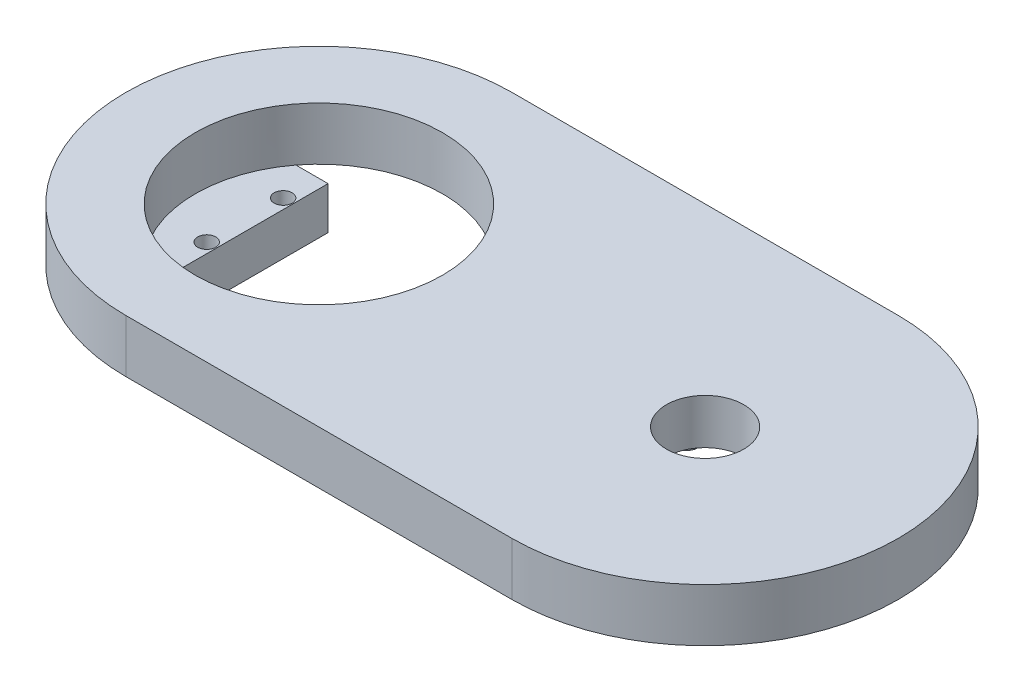
ISO-10303-21;
HEADER;
FILE_DESCRIPTION(('STEP AP214'),'2;1');
FILE_NAME('part.step','',(''),(''),'','','');
FILE_SCHEMA(('AUTOMOTIVE_DESIGN { 1 0 10303 214 1 1 1 1 }'));
ENDSEC;
DATA;
#1=APPLICATION_CONTEXT('core data for automotive mechanical design processes');
#2=APPLICATION_PROTOCOL_DEFINITION('international standard','automotive_design',2000,#1);
#3=PRODUCT_CONTEXT('',#1,'mechanical');
#4=PRODUCT('Part','Part','',(#3));
#5=PRODUCT_RELATED_PRODUCT_CATEGORY('part','',(#4));
#6=PRODUCT_DEFINITION_FORMATION('','',#4);
#7=PRODUCT_DEFINITION_CONTEXT('part definition',#1,'design');
#8=PRODUCT_DEFINITION('design','',#6,#7);
#9=PRODUCT_DEFINITION_SHAPE('','',#8);
#10=(LENGTH_UNIT() NAMED_UNIT(*) SI_UNIT(.MILLI.,.METRE.));
#11=(NAMED_UNIT(*) PLANE_ANGLE_UNIT() SI_UNIT($,.RADIAN.));
#12=(NAMED_UNIT(*) SI_UNIT($,.STERADIAN.) SOLID_ANGLE_UNIT());
#13=UNCERTAINTY_MEASURE_WITH_UNIT(LENGTH_MEASURE(1.E-05),#10,'distance_accuracy_value','');
#14=(GEOMETRIC_REPRESENTATION_CONTEXT(3) GLOBAL_UNCERTAINTY_ASSIGNED_CONTEXT((#13)) GLOBAL_UNIT_ASSIGNED_CONTEXT((#10,
#11,#12)) REPRESENTATION_CONTEXT('',''));
#15=CARTESIAN_POINT('',(0.,0.,0.));
#16=DIRECTION('',(0.,0.,1.));
#17=DIRECTION('',(1.,0.,0.));
#18=AXIS2_PLACEMENT_3D('',#15,#16,#17);
#19=CARTESIAN_POINT('',(-13.2640521637271,0.,0.));
#20=DIRECTION('',(0.,1.,0.));
#21=DIRECTION('',(0.,0.,1.));
#22=AXIS2_PLACEMENT_3D('',#19,#20,#21);
#23=PLANE('',#22);
#24=CARTESIAN_POINT('',(36.7359478362729,0.,0.));
#25=DIRECTION('',(0.,1.,0.));
#26=DIRECTION('',(0.,0.,1.));
#27=AXIS2_PLACEMENT_3D('',#24,#25,#26);
#28=CIRCLE('',#27,12.);
#29=CARTESIAN_POINT('',(36.7359478362729,0.,12.));
#30=VERTEX_POINT('',#29);
#31=EDGE_CURVE('E556',#30,#30,#28,.T.);
#32=ORIENTED_EDGE('',*,*,#31,.T.);
#33=EDGE_LOOP('',(#32));
#34=FACE_BOUND('',#33,.T.);
#35=DIRECTION('',(0.,0.,-1.));
#36=VECTOR('',#35,1.);
#37=CARTESIAN_POINT('',(14.6958744589285,0.,9.35875972704483));
#38=LINE('',#37,#36);
#39=CARTESIAN_POINT('',(14.6958744589285,0.,9.35875972704483));
#40=VERTEX_POINT('',#39);
#41=CARTESIAN_POINT('',(14.6958744589286,0.,-9.64124027295517));
#42=VERTEX_POINT('',#41);
#43=EDGE_CURVE('E149',#40,#42,#38,.T.);
#44=ORIENTED_EDGE('',*,*,#43,.F.);
#45=DIRECTION('',(-1.,0.,0.));
#46=VECTOR('',#45,1.);
#47=CARTESIAN_POINT('',(14.6958744589285,0.,9.35875972704483));
#48=LINE('',#47,#46);
#49=CARTESIAN_POINT('',(21.6958744589286,0.,9.35875972704483));
#50=VERTEX_POINT('',#49);
#51=EDGE_CURVE('E162',#50,#40,#48,.T.);
#52=ORIENTED_EDGE('',*,*,#51,.F.);
#53=DIRECTION('',(0.,0.,1.));
#54=VECTOR('',#53,1.);
#55=CARTESIAN_POINT('',(21.6958744589285,0.,9.35875972704483));
#56=LINE('',#55,#54);
#57=CARTESIAN_POINT('',(21.6958744589286,0.,-9.64124027295517));
#58=VERTEX_POINT('',#57);
#59=EDGE_CURVE('E171',#58,#50,#56,.T.);
#60=ORIENTED_EDGE('',*,*,#59,.F.);
#61=DIRECTION('',(1.,0.,0.));
#62=VECTOR('',#61,1.);
#63=CARTESIAN_POINT('',(14.6958744589286,0.,-9.64124027295517));
#64=LINE('',#63,#62);
#65=EDGE_CURVE('E152',#42,#58,#64,.T.);
#66=ORIENTED_EDGE('',*,*,#65,.F.);
#67=EDGE_LOOP('',(#44,#52,#60,#66));
#68=FACE_BOUND('',#67,.T.);
#69=CARTESIAN_POINT('',(-13.2640521637271,0.,0.));
#70=DIRECTION('',(0.,1.,0.));
#71=DIRECTION('',(0.,0.,1.));
#72=AXIS2_PLACEMENT_3D('',#69,#70,#71);
#73=CIRCLE('',#72,25.);
#74=CARTESIAN_POINT('',(-13.2640521637271,0.,-25.));
#75=VERTEX_POINT('',#74);
#76=CARTESIAN_POINT('',(-13.2640521637271,0.,25.));
#77=VERTEX_POINT('',#76);
#78=EDGE_CURVE('E191',#75,#77,#73,.T.);
#79=ORIENTED_EDGE('',*,*,#78,.F.);
#80=DIRECTION('',(-1.,0.,0.));
#81=VECTOR('',#80,1.);
#82=CARTESIAN_POINT('',(-13.2640521637271,0.,-25.));
#83=LINE('',#82,#81);
#84=CARTESIAN_POINT('',(36.7359478362729,0.,-25.));
#85=VERTEX_POINT('',#84);
#86=EDGE_CURVE('E202',#85,#75,#83,.T.);
#87=ORIENTED_EDGE('',*,*,#86,.F.);
#88=CARTESIAN_POINT('',(36.7359478362729,0.,0.));
#89=DIRECTION('',(0.,1.,0.));
#90=DIRECTION('',(0.,0.,1.));
#91=AXIS2_PLACEMENT_3D('',#88,#89,#90);
#92=CIRCLE('',#91,25.);
#93=CARTESIAN_POINT('',(36.7359478362729,0.,25.));
#94=VERTEX_POINT('',#93);
#95=EDGE_CURVE('E213',#94,#85,#92,.T.);
#96=ORIENTED_EDGE('',*,*,#95,.F.);
#97=DIRECTION('',(1.,0.,0.));
#98=VECTOR('',#97,1.);
#99=CARTESIAN_POINT('',(-13.2640521637271,0.,25.));
#100=LINE('',#99,#98);
#101=EDGE_CURVE('E211',#77,#94,#100,.T.);
#102=ORIENTED_EDGE('',*,*,#101,.F.);
#103=EDGE_LOOP('',(#79,#87,#96,#102));
#104=FACE_BOUND('',#103,.T.);
#105=DIRECTION('',(1.,0.,0.));
#106=VECTOR('',#105,1.);
#107=CARTESIAN_POINT('',(-33.3040521637271,0.,-9.73108181398262));
#108=LINE('',#107,#106);
#109=CARTESIAN_POINT('',(-33.3040521637271,0.,-9.73108181398262));
#110=VERTEX_POINT('',#109);
#111=CARTESIAN_POINT('',(-25.9646839090214,0.,-9.73108181398262));
#112=VERTEX_POINT('',#111);
#113=EDGE_CURVE('E48',#110,#112,#108,.T.);
#114=ORIENTED_EDGE('',*,*,#113,.F.);
#115=DIRECTION('',(0.,0.,-1.));
#116=VECTOR('',#115,1.);
#117=CARTESIAN_POINT('',(-33.3040521637271,0.,9.26891818601738));
#118=LINE('',#117,#116);
#119=CARTESIAN_POINT('',(-33.3040521637271,0.,9.26891818601738));
#120=VERTEX_POINT('',#119);
#121=EDGE_CURVE('E53',#120,#110,#118,.T.);
#122=ORIENTED_EDGE('',*,*,#121,.F.);
#123=DIRECTION('',(-1.,0.,0.));
#124=VECTOR('',#123,1.);
#125=CARTESIAN_POINT('',(-33.3040521637271,0.,9.26891818601738));
#126=LINE('',#125,#124);
#127=CARTESIAN_POINT('',(-26.3057988128886,0.,9.26891818601738));
#128=VERTEX_POINT('',#127);
#129=EDGE_CURVE('E578',#128,#120,#126,.T.);
#130=ORIENTED_EDGE('',*,*,#129,.F.);
#131=CARTESIAN_POINT('',(-13.2640521637271,0.,0.));
#132=DIRECTION('',(0.,1.,0.));
#133=DIRECTION('',(0.,0.,1.));
#134=AXIS2_PLACEMENT_3D('',#131,#132,#133);
#135=CIRCLE('',#134,16.);
#136=EDGE_CURVE('E195',#128,#112,#135,.T.);
#137=ORIENTED_EDGE('',*,*,#136,.T.);
#138=EDGE_LOOP('',(#114,#122,#130,#137));
#139=FACE_BOUND('',#138,.T.);
#140=ADVANCED_FACE('F33',(#34,#68,#104,#139),#23,.F.);
#141=CARTESIAN_POINT('',(-13.2640521637271,6.86,0.));
#142=DIRECTION('',(0.,-1.,0.));
#143=DIRECTION('',(0.,0.,-1.));
#144=AXIS2_PLACEMENT_3D('',#141,#142,#143);
#145=CYLINDRICAL_SURFACE('',#144,25.);
#146=ORIENTED_EDGE('',*,*,#78,.T.);
#147=DIRECTION('',(0.,-1.,0.));
#148=VECTOR('',#147,1.);
#149=CARTESIAN_POINT('',(-13.2640521637271,6.86,25.));
#150=LINE('',#149,#148);
#151=CARTESIAN_POINT('',(-13.2640521637271,6.86,25.));
#152=VERTEX_POINT('',#151);
#153=EDGE_CURVE('E224',#152,#77,#150,.T.);
#154=ORIENTED_EDGE('',*,*,#153,.F.);
#155=CARTESIAN_POINT('',(-13.2640521637271,6.86,0.));
#156=DIRECTION('',(0.,1.,0.));
#157=DIRECTION('',(0.,0.,1.));
#158=AXIS2_PLACEMENT_3D('',#155,#156,#157);
#159=CIRCLE('',#158,25.);
#160=CARTESIAN_POINT('',(-13.2640521637271,6.86,-25.));
#161=VERTEX_POINT('',#160);
#162=EDGE_CURVE('E198',#161,#152,#159,.T.);
#163=ORIENTED_EDGE('',*,*,#162,.F.);
#164=DIRECTION('',(0.,-1.,0.));
#165=VECTOR('',#164,1.);
#166=CARTESIAN_POINT('',(-13.2640521637271,6.86,-25.));
#167=LINE('',#166,#165);
#168=EDGE_CURVE('E208',#161,#75,#167,.T.);
#169=ORIENTED_EDGE('',*,*,#168,.T.);
#170=EDGE_LOOP('',(#146,#154,#163,#169));
#171=FACE_BOUND('',#170,.T.);
#172=ADVANCED_FACE('F35',(#171),#145,.T.);
#173=CARTESIAN_POINT('',(-13.2640521637271,6.86,25.));
#174=DIRECTION('',(0.,0.,-1.));
#175=DIRECTION('',(-1.,0.,0.));
#176=AXIS2_PLACEMENT_3D('',#173,#174,#175);
#177=PLANE('',#176);
#178=ORIENTED_EDGE('',*,*,#101,.T.);
#179=DIRECTION('',(0.,-1.,0.));
#180=VECTOR('',#179,1.);
#181=CARTESIAN_POINT('',(36.7359478362729,6.86,25.));
#182=LINE('',#181,#180);
#183=CARTESIAN_POINT('',(36.7359478362729,6.86,25.));
#184=VERTEX_POINT('',#183);
#185=EDGE_CURVE('E221',#184,#94,#182,.T.);
#186=ORIENTED_EDGE('',*,*,#185,.F.);
#187=DIRECTION('',(1.,0.,0.));
#188=VECTOR('',#187,1.);
#189=CARTESIAN_POINT('',(-13.2640521637271,6.86,25.));
#190=LINE('',#189,#188);
#191=EDGE_CURVE('E201',#152,#184,#190,.T.);
#192=ORIENTED_EDGE('',*,*,#191,.F.);
#193=ORIENTED_EDGE('',*,*,#153,.T.);
#194=EDGE_LOOP('',(#178,#186,#192,#193));
#195=FACE_BOUND('',#194,.T.);
#196=ADVANCED_FACE('F277',(#195),#177,.F.);
#197=CARTESIAN_POINT('',(36.7359478362729,6.86,0.));
#198=DIRECTION('',(0.,-1.,0.));
#199=DIRECTION('',(0.,0.,-1.));
#200=AXIS2_PLACEMENT_3D('',#197,#198,#199);
#201=CYLINDRICAL_SURFACE('',#200,25.);
#202=ORIENTED_EDGE('',*,*,#95,.T.);
#203=DIRECTION('',(0.,-1.,0.));
#204=VECTOR('',#203,1.);
#205=CARTESIAN_POINT('',(36.7359478362729,6.86,-25.));
#206=LINE('',#205,#204);
#207=CARTESIAN_POINT('',(36.7359478362729,6.86,-25.));
#208=VERTEX_POINT('',#207);
#209=EDGE_CURVE('E218',#208,#85,#206,.T.);
#210=ORIENTED_EDGE('',*,*,#209,.F.);
#211=CARTESIAN_POINT('',(36.7359478362729,6.86,0.));
#212=DIRECTION('',(0.,1.,0.));
#213=DIRECTION('',(0.,0.,1.));
#214=AXIS2_PLACEMENT_3D('',#211,#212,#213);
#215=CIRCLE('',#214,25.);
#216=EDGE_CURVE('E204',#184,#208,#215,.T.);
#217=ORIENTED_EDGE('',*,*,#216,.F.);
#218=ORIENTED_EDGE('',*,*,#185,.T.);
#219=EDGE_LOOP('',(#202,#210,#217,#218));
#220=FACE_BOUND('',#219,.T.);
#221=ADVANCED_FACE('F282',(#220),#201,.T.);
#222=CARTESIAN_POINT('',(-13.2640521637271,6.86,-25.));
#223=DIRECTION('',(0.,0.,1.));
#224=DIRECTION('',(1.,0.,0.));
#225=AXIS2_PLACEMENT_3D('',#222,#223,#224);
#226=PLANE('',#225);
#227=ORIENTED_EDGE('',*,*,#86,.T.);
#228=ORIENTED_EDGE('',*,*,#168,.F.);
#229=DIRECTION('',(-1.,0.,0.));
#230=VECTOR('',#229,1.);
#231=CARTESIAN_POINT('',(-13.2640521637271,6.86,-25.));
#232=LINE('',#231,#230);
#233=EDGE_CURVE('E206',#208,#161,#232,.T.);
#234=ORIENTED_EDGE('',*,*,#233,.F.);
#235=ORIENTED_EDGE('',*,*,#209,.T.);
#236=EDGE_LOOP('',(#227,#228,#234,#235));
#237=FACE_BOUND('',#236,.T.);
#238=ADVANCED_FACE('F265',(#237),#226,.F.);
#239=CARTESIAN_POINT('',(-13.2640521637271,6.86,0.));
#240=DIRECTION('',(0.,1.,0.));
#241=DIRECTION('',(0.,0.,1.));
#242=AXIS2_PLACEMENT_3D('',#239,#240,#241);
#243=PLANE('',#242);
#244=CARTESIAN_POINT('',(36.7359478362729,6.86,0.));
#245=DIRECTION('',(0.,1.,0.));
#246=DIRECTION('',(0.,0.,1.));
#247=AXIS2_PLACEMENT_3D('',#244,#245,#246);
#248=CIRCLE('',#247,5.);
#249=CARTESIAN_POINT('',(36.7359478362729,6.86,5.));
#250=VERTEX_POINT('',#249);
#251=EDGE_CURVE('E188',#250,#250,#248,.T.);
#252=ORIENTED_EDGE('',*,*,#251,.F.);
#253=EDGE_LOOP('',(#252));
#254=FACE_BOUND('',#253,.T.);
#255=CARTESIAN_POINT('',(-13.2640521637271,6.86,0.));
#256=DIRECTION('',(0.,1.,0.));
#257=DIRECTION('',(0.,0.,1.));
#258=AXIS2_PLACEMENT_3D('',#255,#256,#257);
#259=CIRCLE('',#258,16.);
#260=CARTESIAN_POINT('',(-13.2640521637271,6.86,16.));
#261=VERTEX_POINT('',#260);
#262=EDGE_CURVE('E187',#261,#261,#259,.T.);
#263=ORIENTED_EDGE('',*,*,#262,.F.);
#264=EDGE_LOOP('',(#263));
#265=FACE_BOUND('',#264,.T.);
#266=ORIENTED_EDGE('',*,*,#162,.T.);
#267=ORIENTED_EDGE('',*,*,#191,.T.);
#268=ORIENTED_EDGE('',*,*,#216,.T.);
#269=ORIENTED_EDGE('',*,*,#233,.T.);
#270=EDGE_LOOP('',(#266,#267,#268,#269));
#271=FACE_BOUND('',#270,.T.);
#272=ADVANCED_FACE('F262',(#254,#265,#271),#243,.T.);
#273=CARTESIAN_POINT('',(-13.2640521637271,0.,0.));
#274=DIRECTION('',(0.,1.,0.));
#275=DIRECTION('',(0.,0.,1.));
#276=AXIS2_PLACEMENT_3D('',#273,#274,#275);
#277=CYLINDRICAL_SURFACE('',#276,16.);
#278=EDGE_CURVE('E192',#112,#128,#135,.T.);
#279=ORIENTED_EDGE('',*,*,#278,.F.);
#280=ORIENTED_EDGE('',*,*,#136,.F.);
#281=EDGE_LOOP('',(#279,#280));
#282=FACE_BOUND('',#281,.T.);
#283=ORIENTED_EDGE('',*,*,#262,.T.);
#284=EDGE_LOOP('',(#283));
#285=FACE_BOUND('',#284,.T.);
#286=ADVANCED_FACE('F258',(#282,#285),#277,.F.);
#287=CARTESIAN_POINT('',(36.7359478362729,0.,0.));
#288=DIRECTION('',(0.,1.,0.));
#289=DIRECTION('',(0.,0.,1.));
#290=AXIS2_PLACEMENT_3D('',#287,#288,#289);
#291=CYLINDRICAL_SURFACE('',#290,5.);
#292=CARTESIAN_POINT('',(36.7359478362729,0.999999999999997,0.));
#293=DIRECTION('',(0.,1.,0.));
#294=DIRECTION('',(0.,0.,1.));
#295=AXIS2_PLACEMENT_3D('',#292,#293,#294);
#296=CIRCLE('',#295,5.);
#297=CARTESIAN_POINT('',(36.7359478362729,0.999999999999997,5.));
#298=VERTEX_POINT('',#297);
#299=EDGE_CURVE('E228',#298,#298,#296,.F.);
#300=ORIENTED_EDGE('',*,*,#299,.T.);
#301=EDGE_LOOP('',(#300));
#302=FACE_BOUND('',#301,.T.);
#303=ORIENTED_EDGE('',*,*,#251,.T.);
#304=EDGE_LOOP('',(#303));
#305=FACE_BOUND('',#304,.T.);
#306=ADVANCED_FACE('F254',(#302,#305),#291,.F.);
#307=CARTESIAN_POINT('',(14.6958744589285,-5.5,9.35875972704483));
#308=DIRECTION('',(1.,0.,0.));
#309=DIRECTION('',(0.,0.,-1.));
#310=AXIS2_PLACEMENT_3D('',#307,#308,#309);
#311=PLANE('',#310);
#312=ORIENTED_EDGE('',*,*,#43,.T.);
#313=DIRECTION('',(0.,1.,0.));
#314=VECTOR('',#313,1.);
#315=CARTESIAN_POINT('',(14.6958744589286,-5.5,-9.64124027295517));
#316=LINE('',#315,#314);
#317=CARTESIAN_POINT('',(14.6958744589286,-5.5,-9.64124027295517));
#318=VERTEX_POINT('',#317);
#319=EDGE_CURVE('E184',#318,#42,#316,.T.);
#320=ORIENTED_EDGE('',*,*,#319,.F.);
#321=DIRECTION('',(0.,0.,-1.));
#322=VECTOR('',#321,1.);
#323=CARTESIAN_POINT('',(14.6958744589285,-5.5,9.35875972704483));
#324=LINE('',#323,#322);
#325=CARTESIAN_POINT('',(14.6958744589285,-5.5,9.35875972704483));
#326=VERTEX_POINT('',#325);
#327=EDGE_CURVE('E158',#326,#318,#324,.T.);
#328=ORIENTED_EDGE('',*,*,#327,.F.);
#329=DIRECTION('',(0.,1.,0.));
#330=VECTOR('',#329,1.);
#331=CARTESIAN_POINT('',(14.6958744589285,-5.5,9.35875972704483));
#332=LINE('',#331,#330);
#333=EDGE_CURVE('E167',#326,#40,#332,.T.);
#334=ORIENTED_EDGE('',*,*,#333,.T.);
#335=EDGE_LOOP('',(#312,#320,#328,#334));
#336=FACE_BOUND('',#335,.T.);
#337=ADVANCED_FACE('F257',(#336),#311,.F.);
#338=CARTESIAN_POINT('',(14.6958744589286,-5.5,-9.64124027295517));
#339=DIRECTION('',(0.,0.,1.));
#340=DIRECTION('',(1.,0.,0.));
#341=AXIS2_PLACEMENT_3D('',#338,#339,#340);
#342=PLANE('',#341);
#343=ORIENTED_EDGE('',*,*,#65,.T.);
#344=DIRECTION('',(0.,1.,0.));
#345=VECTOR('',#344,1.);
#346=CARTESIAN_POINT('',(21.6958744589286,-5.5,-9.64124027295517));
#347=LINE('',#346,#345);
#348=CARTESIAN_POINT('',(21.6958744589286,-5.5,-9.64124027295517));
#349=VERTEX_POINT('',#348);
#350=EDGE_CURVE('E181',#349,#58,#347,.T.);
#351=ORIENTED_EDGE('',*,*,#350,.F.);
#352=DIRECTION('',(1.,0.,0.));
#353=VECTOR('',#352,1.);
#354=CARTESIAN_POINT('',(14.6958744589286,-5.5,-9.64124027295517));
#355=LINE('',#354,#353);
#356=EDGE_CURVE('E161',#318,#349,#355,.T.);
#357=ORIENTED_EDGE('',*,*,#356,.F.);
#358=ORIENTED_EDGE('',*,*,#319,.T.);
#359=EDGE_LOOP('',(#343,#351,#357,#358));
#360=FACE_BOUND('',#359,.T.);
#361=ADVANCED_FACE('F333',(#360),#342,.F.);
#362=CARTESIAN_POINT('',(21.6958744589285,-5.5,9.35875972704483));
#363=DIRECTION('',(-1.,0.,0.));
#364=DIRECTION('',(0.,0.,1.));
#365=AXIS2_PLACEMENT_3D('',#362,#363,#364);
#366=PLANE('',#365);
#367=ORIENTED_EDGE('',*,*,#59,.T.);
#368=DIRECTION('',(0.,1.,0.));
#369=VECTOR('',#368,1.);
#370=CARTESIAN_POINT('',(21.6958744589285,-5.5,9.35875972704483));
#371=LINE('',#370,#369);
#372=CARTESIAN_POINT('',(21.6958744589285,-5.5,9.35875972704483));
#373=VERTEX_POINT('',#372);
#374=EDGE_CURVE('E178',#373,#50,#371,.T.);
#375=ORIENTED_EDGE('',*,*,#374,.F.);
#376=DIRECTION('',(0.,0.,1.));
#377=VECTOR('',#376,1.);
#378=CARTESIAN_POINT('',(21.6958744589285,-5.5,9.35875972704483));
#379=LINE('',#378,#377);
#380=EDGE_CURVE('E164',#349,#373,#379,.T.);
#381=ORIENTED_EDGE('',*,*,#380,.F.);
#382=ORIENTED_EDGE('',*,*,#350,.T.);
#383=EDGE_LOOP('',(#367,#375,#381,#382));
#384=FACE_BOUND('',#383,.T.);
#385=ADVANCED_FACE('F341',(#384),#366,.F.);
#386=CARTESIAN_POINT('',(14.6958744589285,-5.5,9.35875972704483));
#387=DIRECTION('',(0.,0.,-1.));
#388=DIRECTION('',(-1.,0.,0.));
#389=AXIS2_PLACEMENT_3D('',#386,#387,#388);
#390=PLANE('',#389);
#391=ORIENTED_EDGE('',*,*,#51,.T.);
#392=ORIENTED_EDGE('',*,*,#333,.F.);
#393=DIRECTION('',(-1.,0.,0.));
#394=VECTOR('',#393,1.);
#395=CARTESIAN_POINT('',(14.6958744589285,-5.5,9.35875972704483));
#396=LINE('',#395,#394);
#397=EDGE_CURVE('E166',#373,#326,#396,.T.);
#398=ORIENTED_EDGE('',*,*,#397,.F.);
#399=ORIENTED_EDGE('',*,*,#374,.T.);
#400=EDGE_LOOP('',(#391,#392,#398,#399));
#401=FACE_BOUND('',#400,.T.);
#402=ADVANCED_FACE('F349',(#401),#390,.F.);
#403=CARTESIAN_POINT('',(0.,-5.5,0.));
#404=DIRECTION('',(0.,-1.,0.));
#405=DIRECTION('',(0.,0.,-1.));
#406=AXIS2_PLACEMENT_3D('',#403,#404,#405);
#407=PLANE('',#406);
#408=ORIENTED_EDGE('',*,*,#327,.T.);
#409=ORIENTED_EDGE('',*,*,#356,.T.);
#410=ORIENTED_EDGE('',*,*,#380,.T.);
#411=ORIENTED_EDGE('',*,*,#397,.T.);
#412=EDGE_LOOP('',(#408,#409,#410,#411));
#413=FACE_BOUND('',#412,.T.);
#414=ADVANCED_FACE('F357',(#413),#407,.T.);
#415=CARTESIAN_POINT('',(0.,0.,0.));
#416=DIRECTION('',(0.,-1.,0.));
#417=DIRECTION('',(0.,0.,-1.));
#418=AXIS2_PLACEMENT_3D('',#415,#416,#417);
#419=PLANE('',#418);
#420=CARTESIAN_POINT('',(-23.1040521637271,0.,4.67891818601738));
#421=DIRECTION('',(0.,-1.,0.));
#422=DIRECTION('',(0.,0.,-1.));
#423=AXIS2_PLACEMENT_3D('',#420,#421,#422);
#424=CIRCLE('',#423,1.16499999999974);
#425=CARTESIAN_POINT('',(-23.1040521637271,0.,3.51391818601765));
#426=VERTEX_POINT('',#425);
#427=EDGE_CURVE('E567',#426,#426,#424,.T.);
#428=ORIENTED_EDGE('',*,*,#427,.T.);
#429=EDGE_LOOP('',(#428));
#430=FACE_BOUND('',#429,.T.);
#431=CARTESIAN_POINT('',(-23.1040521637271,0.,-5.21108181398262));
#432=DIRECTION('',(0.,-1.,0.));
#433=DIRECTION('',(0.,0.,-1.));
#434=AXIS2_PLACEMENT_3D('',#431,#432,#433);
#435=CIRCLE('',#434,1.16499999999973);
#436=CARTESIAN_POINT('',(-23.1040521637271,0.,-6.37608181398235));
#437=VERTEX_POINT('',#436);
#438=EDGE_CURVE('E562',#437,#437,#435,.T.);
#439=ORIENTED_EDGE('',*,*,#438,.T.);
#440=EDGE_LOOP('',(#439));
#441=FACE_BOUND('',#440,.T.);
#442=CARTESIAN_POINT('',(-21.8040521637271,0.,-9.73108181398262));
#443=VERTEX_POINT('',#442);
#444=EDGE_CURVE('E574',#112,#443,#108,.T.);
#445=ORIENTED_EDGE('',*,*,#444,.F.);
#446=ORIENTED_EDGE('',*,*,#278,.T.);
#447=CARTESIAN_POINT('',(-21.8040521637271,0.,9.26891818601739));
#448=VERTEX_POINT('',#447);
#449=EDGE_CURVE('E146',#448,#128,#126,.T.);
#450=ORIENTED_EDGE('',*,*,#449,.F.);
#451=DIRECTION('',(0.,0.,1.));
#452=VECTOR('',#451,1.);
#453=CARTESIAN_POINT('',(-21.8040521637271,0.,9.26891818601739));
#454=LINE('',#453,#452);
#455=EDGE_CURVE('E576',#443,#448,#454,.T.);
#456=ORIENTED_EDGE('',*,*,#455,.F.);
#457=EDGE_LOOP('',(#445,#446,#450,#456));
#458=FACE_BOUND('',#457,.T.);
#459=ADVANCED_FACE('F365',(#430,#441,#458),#419,.F.);
#460=CARTESIAN_POINT('',(-33.3040521637271,-5.5,9.26891818601738));
#461=DIRECTION('',(1.,0.,0.));
#462=DIRECTION('',(0.,0.,-1.));
#463=AXIS2_PLACEMENT_3D('',#460,#461,#462);
#464=PLANE('',#463);
#465=ORIENTED_EDGE('',*,*,#121,.T.);
#466=DIRECTION('',(0.,1.,0.));
#467=VECTOR('',#466,1.);
#468=CARTESIAN_POINT('',(-33.3040521637271,-5.5,-9.73108181398262));
#469=LINE('',#468,#467);
#470=CARTESIAN_POINT('',(-33.3040521637271,-5.5,-9.73108181398262));
#471=VERTEX_POINT('',#470);
#472=EDGE_CURVE('E131',#471,#110,#469,.T.);
#473=ORIENTED_EDGE('',*,*,#472,.F.);
#474=DIRECTION('',(0.,0.,-1.));
#475=VECTOR('',#474,1.);
#476=CARTESIAN_POINT('',(-33.3040521637271,-5.5,9.26891818601738));
#477=LINE('',#476,#475);
#478=CARTESIAN_POINT('',(-33.3040521637271,-5.5,9.26891818601738));
#479=VERTEX_POINT('',#478);
#480=EDGE_CURVE('E137',#479,#471,#477,.T.);
#481=ORIENTED_EDGE('',*,*,#480,.F.);
#482=DIRECTION('',(0.,1.,0.));
#483=VECTOR('',#482,1.);
#484=CARTESIAN_POINT('',(-33.3040521637271,-5.5,9.26891818601738));
#485=LINE('',#484,#483);
#486=EDGE_CURVE('E572',#479,#120,#485,.T.);
#487=ORIENTED_EDGE('',*,*,#486,.T.);
#488=EDGE_LOOP('',(#465,#473,#481,#487));
#489=FACE_BOUND('',#488,.T.);
#490=ADVANCED_FACE('F148',(#489),#464,.F.);
#491=CARTESIAN_POINT('',(-33.3040521637271,-5.5,-9.73108181398262));
#492=DIRECTION('',(0.,0.,1.));
#493=DIRECTION('',(1.,0.,0.));
#494=AXIS2_PLACEMENT_3D('',#491,#492,#493);
#495=PLANE('',#494);
#496=ORIENTED_EDGE('',*,*,#113,.T.);
#497=ORIENTED_EDGE('',*,*,#444,.T.);
#498=DIRECTION('',(0.,1.,0.));
#499=VECTOR('',#498,1.);
#500=CARTESIAN_POINT('',(-21.8040521637271,-5.5,-9.73108181398262));
#501=LINE('',#500,#499);
#502=CARTESIAN_POINT('',(-21.8040521637271,-5.5,-9.73108181398262));
#503=VERTEX_POINT('',#502);
#504=EDGE_CURVE('E133',#503,#443,#501,.T.);
#505=ORIENTED_EDGE('',*,*,#504,.F.);
#506=DIRECTION('',(1.,0.,0.));
#507=VECTOR('',#506,1.);
#508=CARTESIAN_POINT('',(-33.3040521637271,-5.5,-9.73108181398262));
#509=LINE('',#508,#507);
#510=EDGE_CURVE('E127',#471,#503,#509,.T.);
#511=ORIENTED_EDGE('',*,*,#510,.F.);
#512=ORIENTED_EDGE('',*,*,#472,.T.);
#513=EDGE_LOOP('',(#496,#497,#505,#511,#512));
#514=FACE_BOUND('',#513,.T.);
#515=ADVANCED_FACE('F129',(#514),#495,.F.);
#516=CARTESIAN_POINT('',(-21.8040521637271,-5.5,9.26891818601739));
#517=DIRECTION('',(-1.,0.,0.));
#518=DIRECTION('',(0.,0.,1.));
#519=AXIS2_PLACEMENT_3D('',#516,#517,#518);
#520=PLANE('',#519);
#521=ORIENTED_EDGE('',*,*,#455,.T.);
#522=DIRECTION('',(0.,1.,0.));
#523=VECTOR('',#522,1.);
#524=CARTESIAN_POINT('',(-21.8040521637271,-5.5,9.26891818601739));
#525=LINE('',#524,#523);
#526=CARTESIAN_POINT('',(-21.8040521637271,-5.5,9.26891818601739));
#527=VERTEX_POINT('',#526);
#528=EDGE_CURVE('E154',#527,#448,#525,.T.);
#529=ORIENTED_EDGE('',*,*,#528,.F.);
#530=DIRECTION('',(0.,0.,1.));
#531=VECTOR('',#530,1.);
#532=CARTESIAN_POINT('',(-21.8040521637271,-5.5,9.26891818601739));
#533=LINE('',#532,#531);
#534=EDGE_CURVE('E136',#503,#527,#533,.T.);
#535=ORIENTED_EDGE('',*,*,#534,.F.);
#536=ORIENTED_EDGE('',*,*,#504,.T.);
#537=EDGE_LOOP('',(#521,#529,#535,#536));
#538=FACE_BOUND('',#537,.T.);
#539=ADVANCED_FACE('F388',(#538),#520,.F.);
#540=CARTESIAN_POINT('',(-33.3040521637271,-5.5,9.26891818601738));
#541=DIRECTION('',(0.,0.,-1.));
#542=DIRECTION('',(-1.,0.,0.));
#543=AXIS2_PLACEMENT_3D('',#540,#541,#542);
#544=PLANE('',#543);
#545=ORIENTED_EDGE('',*,*,#449,.T.);
#546=ORIENTED_EDGE('',*,*,#129,.T.);
#547=ORIENTED_EDGE('',*,*,#486,.F.);
#548=DIRECTION('',(-1.,0.,0.));
#549=VECTOR('',#548,1.);
#550=CARTESIAN_POINT('',(-33.3040521637271,-5.5,9.26891818601738));
#551=LINE('',#550,#549);
#552=EDGE_CURVE('E142',#527,#479,#551,.T.);
#553=ORIENTED_EDGE('',*,*,#552,.F.);
#554=ORIENTED_EDGE('',*,*,#528,.T.);
#555=EDGE_LOOP('',(#545,#546,#547,#553,#554));
#556=FACE_BOUND('',#555,.T.);
#557=ADVANCED_FACE('F395',(#556),#544,.F.);
#558=CARTESIAN_POINT('',(0.,-5.5,0.));
#559=DIRECTION('',(0.,-1.,0.));
#560=DIRECTION('',(0.,0.,-1.));
#561=AXIS2_PLACEMENT_3D('',#558,#559,#560);
#562=PLANE('',#561);
#563=CARTESIAN_POINT('',(-23.1040521637271,-5.5,4.67891818601738));
#564=DIRECTION('',(0.,-1.,0.));
#565=DIRECTION('',(0.,0.,-1.));
#566=AXIS2_PLACEMENT_3D('',#563,#564,#565);
#567=CIRCLE('',#566,1.16499999999974);
#568=CARTESIAN_POINT('',(-23.1040521637271,-5.5,3.51391818601765));
#569=VERTEX_POINT('',#568);
#570=EDGE_CURVE('E559',#569,#569,#567,.T.);
#571=ORIENTED_EDGE('',*,*,#570,.F.);
#572=EDGE_LOOP('',(#571));
#573=FACE_BOUND('',#572,.T.);
#574=CARTESIAN_POINT('',(-23.1040521637271,-5.5,-5.21108181398262));
#575=DIRECTION('',(0.,-1.,0.));
#576=DIRECTION('',(0.,0.,-1.));
#577=AXIS2_PLACEMENT_3D('',#574,#575,#576);
#578=CIRCLE('',#577,1.16499999999973);
#579=CARTESIAN_POINT('',(-23.1040521637271,-5.5,-6.37608181398235));
#580=VERTEX_POINT('',#579);
#581=EDGE_CURVE('E231',#580,#580,#578,.T.);
#582=ORIENTED_EDGE('',*,*,#581,.F.);
#583=EDGE_LOOP('',(#582));
#584=FACE_BOUND('',#583,.T.);
#585=ORIENTED_EDGE('',*,*,#480,.T.);
#586=ORIENTED_EDGE('',*,*,#510,.T.);
#587=ORIENTED_EDGE('',*,*,#534,.T.);
#588=ORIENTED_EDGE('',*,*,#552,.T.);
#589=EDGE_LOOP('',(#585,#586,#587,#588));
#590=FACE_BOUND('',#589,.T.);
#591=ADVANCED_FACE('F140',(#573,#584,#590),#562,.T.);
#592=CARTESIAN_POINT('',(-23.1040521637271,7.,-5.21108181398262));
#593=DIRECTION('',(0.,-1.,0.));
#594=DIRECTION('',(0.,0.,-1.));
#595=AXIS2_PLACEMENT_3D('',#592,#593,#594);
#596=CYLINDRICAL_SURFACE('',#595,1.16499999999973);
#597=ORIENTED_EDGE('',*,*,#581,.T.);
#598=EDGE_LOOP('',(#597));
#599=FACE_BOUND('',#598,.T.);
#600=ORIENTED_EDGE('',*,*,#438,.F.);
#601=EDGE_LOOP('',(#600));
#602=FACE_BOUND('',#601,.T.);
#603=ADVANCED_FACE('F408',(#599,#602),#596,.F.);
#604=CARTESIAN_POINT('',(-23.1040521637271,7.,4.67891818601738));
#605=DIRECTION('',(0.,-1.,0.));
#606=DIRECTION('',(0.,0.,-1.));
#607=AXIS2_PLACEMENT_3D('',#604,#605,#606);
#608=CYLINDRICAL_SURFACE('',#607,1.16499999999974);
#609=ORIENTED_EDGE('',*,*,#570,.T.);
#610=EDGE_LOOP('',(#609));
#611=FACE_BOUND('',#610,.T.);
#612=ORIENTED_EDGE('',*,*,#427,.F.);
#613=EDGE_LOOP('',(#612));
#614=FACE_BOUND('',#613,.T.);
#615=ADVANCED_FACE('F244',(#611,#614),#608,.F.);
#616=CARTESIAN_POINT('',(36.7359478362729,0.999999999999997,0.));
#617=DIRECTION('',(0.,1.,0.));
#618=DIRECTION('',(0.,0.,1.));
#619=AXIS2_PLACEMENT_3D('',#616,#617,#618);
#620=PLANE('',#619);
#621=CARTESIAN_POINT('',(44.2438425865796,0.999999999999997,-4.96582590432496));
#622=DIRECTION('',(0.,1.,0.));
#623=DIRECTION('',(0.,0.,1.));
#624=AXIS2_PLACEMENT_3D('',#621,#622,#623);
#625=CIRCLE('',#624,1.49999999999968);
#626=CARTESIAN_POINT('',(44.2438425865796,0.999999999999997,-3.46582590432528));
#627=VERTEX_POINT('',#626);
#628=EDGE_CURVE('E11',#627,#627,#625,.F.);
#629=ORIENTED_EDGE('',*,*,#628,.F.);
#630=EDGE_LOOP('',(#629));
#631=FACE_BOUND('',#630,.T.);
#632=CARTESIAN_POINT('',(29.2680340317251,0.999999999999997,-5.05917388697173));
#633=DIRECTION('',(0.,1.,0.));
#634=DIRECTION('',(0.,0.,1.));
#635=AXIS2_PLACEMENT_3D('',#632,#633,#634);
#636=CIRCLE('',#635,1.49370741507648);
#637=CARTESIAN_POINT('',(29.2680340317251,0.999999999999997,-3.56546647189525));
#638=VERTEX_POINT('',#637);
#639=EDGE_CURVE('E41',#638,#638,#636,.F.);
#640=ORIENTED_EDGE('',*,*,#639,.F.);
#641=EDGE_LOOP('',(#640));
#642=FACE_BOUND('',#641,.T.);
#643=CARTESIAN_POINT('',(36.7359478362721,0.999999999999997,9.));
#644=DIRECTION('',(0.,1.,0.));
#645=DIRECTION('',(0.,0.,1.));
#646=AXIS2_PLACEMENT_3D('',#643,#644,#645);
#647=CIRCLE('',#646,1.50000000000107);
#648=CARTESIAN_POINT('',(36.7359478362721,0.999999999999997,10.5000000000011));
#649=VERTEX_POINT('',#648);
#650=EDGE_CURVE('E227',#649,#649,#647,.F.);
#651=ORIENTED_EDGE('',*,*,#650,.F.);
#652=EDGE_LOOP('',(#651));
#653=FACE_BOUND('',#652,.T.);
#654=CARTESIAN_POINT('',(36.7359478362729,0.999999999999997,0.));
#655=DIRECTION('',(0.,1.,0.));
#656=DIRECTION('',(0.,0.,1.));
#657=AXIS2_PLACEMENT_3D('',#654,#655,#656);
#658=CIRCLE('',#657,12.);
#659=CARTESIAN_POINT('',(36.7359478362729,0.999999999999997,12.));
#660=VERTEX_POINT('',#659);
#661=EDGE_CURVE('E232',#660,#660,#658,.T.);
#662=ORIENTED_EDGE('',*,*,#661,.F.);
#663=EDGE_LOOP('',(#662));
#664=FACE_BOUND('',#663,.T.);
#665=ORIENTED_EDGE('',*,*,#299,.F.);
#666=EDGE_LOOP('',(#665));
#667=FACE_BOUND('',#666,.T.);
#668=ADVANCED_FACE('F240',(#631,#642,#653,#664,#667),#620,.F.);
#669=CARTESIAN_POINT('',(36.7359478362729,0.999999999999997,0.));
#670=DIRECTION('',(0.,-1.,0.));
#671=DIRECTION('',(0.,0.,-1.));
#672=AXIS2_PLACEMENT_3D('',#669,#670,#671);
#673=CYLINDRICAL_SURFACE('',#672,12.);
#674=ORIENTED_EDGE('',*,*,#661,.T.);
#675=EDGE_LOOP('',(#674));
#676=FACE_BOUND('',#675,.T.);
#677=ORIENTED_EDGE('',*,*,#31,.F.);
#678=EDGE_LOOP('',(#677));
#679=FACE_BOUND('',#678,.T.);
#680=ADVANCED_FACE('F243',(#676,#679),#673,.F.);
#681=CARTESIAN_POINT('',(36.7359478362721,0.999999999999997,9.));
#682=DIRECTION('',(0.,-1.,0.));
#683=DIRECTION('',(0.,0.,-1.));
#684=AXIS2_PLACEMENT_3D('',#681,#682,#683);
#685=CYLINDRICAL_SURFACE('',#684,1.50000000000107);
#686=ORIENTED_EDGE('',*,*,#650,.T.);
#687=EDGE_LOOP('',(#686));
#688=FACE_BOUND('',#687,.T.);
#689=CARTESIAN_POINT('',(36.7359478362721,-0.999999999999997,9.));
#690=DIRECTION('',(0.,1.,0.));
#691=DIRECTION('',(0.,0.,1.));
#692=AXIS2_PLACEMENT_3D('',#689,#690,#691);
#693=CIRCLE('',#692,1.50000000000107);
#694=CARTESIAN_POINT('',(36.7359478362721,-0.999999999999997,10.5000000000011));
#695=VERTEX_POINT('',#694);
#696=EDGE_CURVE('E551',#695,#695,#693,.T.);
#697=ORIENTED_EDGE('',*,*,#696,.T.);
#698=EDGE_LOOP('',(#697));
#699=FACE_BOUND('',#698,.T.);
#700=ADVANCED_FACE('F434',(#688,#699),#685,.T.);
#701=CARTESIAN_POINT('',(36.7359478362721,-0.999999999999997,9.));
#702=DIRECTION('',(0.,1.,0.));
#703=DIRECTION('',(0.,0.,1.));
#704=AXIS2_PLACEMENT_3D('',#701,#702,#703);
#705=PLANE('',#704);
#706=ORIENTED_EDGE('',*,*,#696,.F.);
#707=EDGE_LOOP('',(#706));
#708=FACE_BOUND('',#707,.T.);
#709=ADVANCED_FACE('F441',(#708),#705,.F.);
#710=CARTESIAN_POINT('',(29.2680340317251,0.999999999999997,-5.05917388697173));
#711=DIRECTION('',(0.,-1.,0.));
#712=DIRECTION('',(0.,0.,-1.));
#713=AXIS2_PLACEMENT_3D('',#710,#711,#712);
#714=CYLINDRICAL_SURFACE('',#713,1.49370741507648);
#715=ORIENTED_EDGE('',*,*,#639,.T.);
#716=EDGE_LOOP('',(#715));
#717=FACE_BOUND('',#716,.T.);
#718=CARTESIAN_POINT('',(29.2680340317251,-0.999999999999997,-5.05917388697173));
#719=DIRECTION('',(0.,1.,0.));
#720=DIRECTION('',(0.,0.,1.));
#721=AXIS2_PLACEMENT_3D('',#718,#719,#720);
#722=CIRCLE('',#721,1.49370741507648);
#723=CARTESIAN_POINT('',(29.2680340317251,-0.999999999999997,-3.56546647189525));
#724=VERTEX_POINT('',#723);
#725=EDGE_CURVE('E548',#724,#724,#722,.T.);
#726=ORIENTED_EDGE('',*,*,#725,.T.);
#727=EDGE_LOOP('',(#726));
#728=FACE_BOUND('',#727,.T.);
#729=ADVANCED_FACE('F237',(#717,#728),#714,.T.);
#730=CARTESIAN_POINT('',(29.2680340317251,-0.999999999999997,-5.05917388697173));
#731=DIRECTION('',(0.,1.,0.));
#732=DIRECTION('',(0.,0.,1.));
#733=AXIS2_PLACEMENT_3D('',#730,#731,#732);
#734=PLANE('',#733);
#735=ORIENTED_EDGE('',*,*,#725,.F.);
#736=EDGE_LOOP('',(#735));
#737=FACE_BOUND('',#736,.T.);
#738=ADVANCED_FACE('F456',(#737),#734,.F.);
#739=CARTESIAN_POINT('',(44.2438425865796,0.999999999999997,-4.96582590432496));
#740=DIRECTION('',(0.,-1.,0.));
#741=DIRECTION('',(0.,0.,-1.));
#742=AXIS2_PLACEMENT_3D('',#739,#740,#741);
#743=CYLINDRICAL_SURFACE('',#742,1.49999999999968);
#744=ORIENTED_EDGE('',*,*,#628,.T.);
#745=EDGE_LOOP('',(#744));
#746=FACE_BOUND('',#745,.T.);
#747=CARTESIAN_POINT('',(44.2438425865796,-0.999999999999997,-4.96582590432496));
#748=DIRECTION('',(0.,1.,0.));
#749=DIRECTION('',(0.,0.,1.));
#750=AXIS2_PLACEMENT_3D('',#747,#748,#749);
#751=CIRCLE('',#750,1.49999999999968);
#752=CARTESIAN_POINT('',(44.2438425865796,-0.999999999999997,-3.46582590432528));
#753=VERTEX_POINT('',#752);
#754=EDGE_CURVE('E546',#753,#753,#751,.T.);
#755=ORIENTED_EDGE('',*,*,#754,.T.);
#756=EDGE_LOOP('',(#755));
#757=FACE_BOUND('',#756,.T.);
#758=ADVANCED_FACE('F463',(#746,#757),#743,.T.);
#759=CARTESIAN_POINT('',(44.2438425865796,-0.999999999999997,-4.96582590432496));
#760=DIRECTION('',(0.,1.,0.));
#761=DIRECTION('',(0.,0.,1.));
#762=AXIS2_PLACEMENT_3D('',#759,#760,#761);
#763=PLANE('',#762);
#764=ORIENTED_EDGE('',*,*,#754,.F.);
#765=EDGE_LOOP('',(#764));
#766=FACE_BOUND('',#765,.T.);
#767=ADVANCED_FACE('F471',(#766),#763,.F.);
#768=CLOSED_SHELL('',(#140,#172,#196,#221,#238,#272,#286,#306,#337,#361,#385,#402,#414,#459,
#490,#515,#539,#557,#591,#603,#615,#668,#680,#700,#709,#729,#738,#758,#767));
#769=MANIFOLD_SOLID_BREP('B2',#768);
#770=ADVANCED_BREP_SHAPE_REPRESENTATION('',(#18,#769),#14);
#771=SHAPE_DEFINITION_REPRESENTATION(#9,#770);
ENDSEC;
END-ISO-10303-21;
